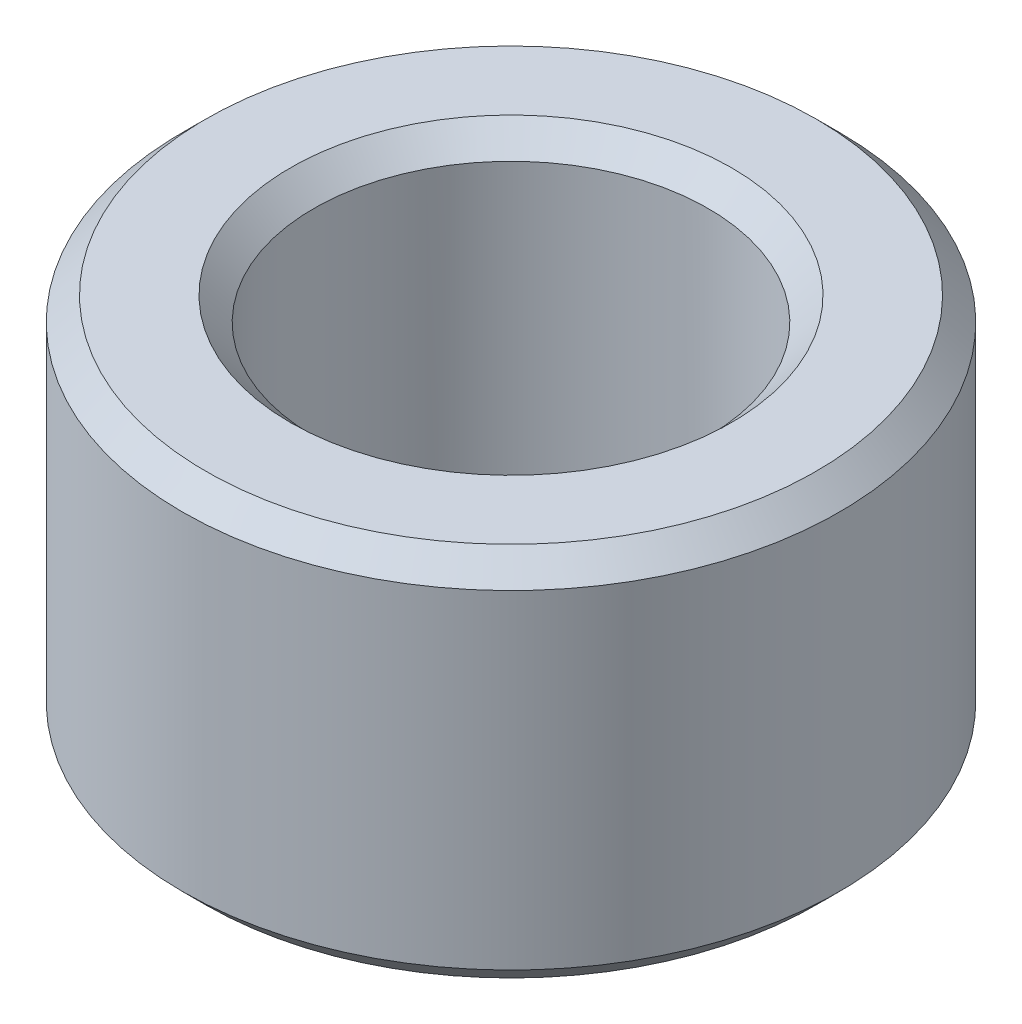
ISO-10303-21;
HEADER;
FILE_DESCRIPTION(('STEP AP214'),'2;1');
FILE_NAME('part.step','',(''),(''),'','','');
FILE_SCHEMA(('AUTOMOTIVE_DESIGN { 1 0 10303 214 1 1 1 1 }'));
ENDSEC;
DATA;
#1=APPLICATION_CONTEXT('core data for automotive mechanical design processes');
#2=APPLICATION_PROTOCOL_DEFINITION('international standard','automotive_design',2000,#1);
#3=PRODUCT_CONTEXT('',#1,'mechanical');
#4=PRODUCT('Part','Part','',(#3));
#5=PRODUCT_RELATED_PRODUCT_CATEGORY('part','',(#4));
#6=PRODUCT_DEFINITION_FORMATION('','',#4);
#7=PRODUCT_DEFINITION_CONTEXT('part definition',#1,'design');
#8=PRODUCT_DEFINITION('design','',#6,#7);
#9=PRODUCT_DEFINITION_SHAPE('','',#8);
#10=(LENGTH_UNIT() NAMED_UNIT(*) SI_UNIT(.MILLI.,.METRE.));
#11=(NAMED_UNIT(*) PLANE_ANGLE_UNIT() SI_UNIT($,.RADIAN.));
#12=(NAMED_UNIT(*) SI_UNIT($,.STERADIAN.) SOLID_ANGLE_UNIT());
#13=UNCERTAINTY_MEASURE_WITH_UNIT(LENGTH_MEASURE(1.E-05),#10,'distance_accuracy_value','');
#14=(GEOMETRIC_REPRESENTATION_CONTEXT(3) GLOBAL_UNCERTAINTY_ASSIGNED_CONTEXT((#13)) GLOBAL_UNIT_ASSIGNED_CONTEXT((#10,
#11,#12)) REPRESENTATION_CONTEXT('',''));
#15=CARTESIAN_POINT('',(0.,0.,0.));
#16=DIRECTION('',(0.,0.,1.));
#17=DIRECTION('',(1.,0.,0.));
#18=AXIS2_PLACEMENT_3D('',#15,#16,#17);
#19=CARTESIAN_POINT('',(0.,0.,0.));
#20=DIRECTION('',(0.,1.,0.));
#21=DIRECTION('',(0.,0.,1.));
#22=AXIS2_PLACEMENT_3D('',#19,#20,#21);
#23=CYLINDRICAL_SURFACE('',#22,2.1);
#24=CARTESIAN_POINT('',(0.,0.250000000050932,0.));
#25=DIRECTION('',(0.,-1.,0.));
#26=DIRECTION('',(1.,0.,0.));
#27=AXIS2_PLACEMENT_3D('',#24,#25,#26);
#28=CIRCLE('',#27,2.09999999998445);
#29=CARTESIAN_POINT('',(2.09999999998445,0.250000000050932,0.));
#30=VERTEX_POINT('',#29);
#31=EDGE_CURVE('E30',#30,#30,#28,.T.);
#32=ORIENTED_EDGE('',*,*,#31,.T.);
#33=EDGE_LOOP('',(#32));
#34=FACE_BOUND('',#33,.T.);
#35=CARTESIAN_POINT('',(0.,3.74999999996817,0.));
#36=DIRECTION('',(0.,1.,0.));
#37=DIRECTION('',(1.,0.,0.));
#38=AXIS2_PLACEMENT_3D('',#35,#36,#37);
#39=CIRCLE('',#38,2.09999999998445);
#40=CARTESIAN_POINT('',(2.09999999998445,3.74999999996817,0.));
#41=VERTEX_POINT('',#40);
#42=EDGE_CURVE('E33',#41,#41,#39,.T.);
#43=ORIENTED_EDGE('',*,*,#42,.T.);
#44=EDGE_LOOP('',(#43));
#45=FACE_BOUND('',#44,.T.);
#46=ADVANCED_FACE('F15',(#34,#45),#23,.F.);
#47=CARTESIAN_POINT('',(0.,4.0000000000191,0.));
#48=DIRECTION('',(0.,1.,0.));
#49=DIRECTION('',(0.,0.,1.));
#50=AXIS2_PLACEMENT_3D('',#47,#48,#49);
#51=CONICAL_SURFACE('',#50,2.34999999997854,0.785398163283761);
#52=ORIENTED_EDGE('',*,*,#42,.F.);
#53=EDGE_LOOP('',(#52));
#54=FACE_BOUND('',#53,.T.);
#55=CARTESIAN_POINT('',(0.,4.0000000000191,0.));
#56=DIRECTION('',(0.,1.,0.));
#57=DIRECTION('',(0.,0.,1.));
#58=AXIS2_PLACEMENT_3D('',#55,#56,#57);
#59=CIRCLE('',#58,2.34999999997854);
#60=CARTESIAN_POINT('',(0.,4.0000000000191,2.34999999997854));
#61=VERTEX_POINT('',#60);
#62=EDGE_CURVE('E18',#61,#61,#59,.F.);
#63=ORIENTED_EDGE('',*,*,#62,.F.);
#64=EDGE_LOOP('',(#63));
#65=FACE_BOUND('',#64,.T.);
#66=ADVANCED_FACE('F50',(#54,#65),#51,.F.);
#67=CARTESIAN_POINT('',(0.,5.6843418860808E-11,0.));
#68=DIRECTION('',(0.,-1.,0.));
#69=DIRECTION('',(0.,0.,-1.));
#70=AXIS2_PLACEMENT_3D('',#67,#68,#69);
#71=CONICAL_SURFACE('',#70,2.34999999997854,0.785398163397448);
#72=CARTESIAN_POINT('',(0.,5.6843418860808E-11,0.));
#73=DIRECTION('',(0.,-1.,0.));
#74=DIRECTION('',(0.,0.,-1.));
#75=AXIS2_PLACEMENT_3D('',#72,#73,#74);
#76=CIRCLE('',#75,2.34999999997854);
#77=CARTESIAN_POINT('',(0.,5.6843418860808E-11,-2.34999999997854));
#78=VERTEX_POINT('',#77);
#79=EDGE_CURVE('E40',#78,#78,#76,.T.);
#80=ORIENTED_EDGE('',*,*,#79,.T.);
#81=EDGE_LOOP('',(#80));
#82=FACE_BOUND('',#81,.T.);
#83=ORIENTED_EDGE('',*,*,#31,.F.);
#84=EDGE_LOOP('',(#83));
#85=FACE_BOUND('',#84,.T.);
#86=ADVANCED_FACE('F52',(#82,#85),#71,.F.);
#87=CARTESIAN_POINT('',(0.,4.,0.));
#88=DIRECTION('',(0.,1.,0.));
#89=DIRECTION('',(0.,0.,1.));
#90=AXIS2_PLACEMENT_3D('',#87,#88,#89);
#91=PLANE('',#90);
#92=ORIENTED_EDGE('',*,*,#62,.T.);
#93=EDGE_LOOP('',(#92));
#94=FACE_BOUND('',#93,.T.);
#95=CARTESIAN_POINT('',(0.,3.99999999996226,0.));
#96=DIRECTION('',(0.,-1.,0.));
#97=DIRECTION('',(0.,0.,-1.));
#98=AXIS2_PLACEMENT_3D('',#95,#96,#97);
#99=CIRCLE('',#98,3.24999999997999);
#100=CARTESIAN_POINT('',(0.,3.99999999996226,-3.24999999997999));
#101=VERTEX_POINT('',#100);
#102=EDGE_CURVE('E38',#101,#101,#99,.T.);
#103=ORIENTED_EDGE('',*,*,#102,.F.);
#104=EDGE_LOOP('',(#103));
#105=FACE_BOUND('',#104,.T.);
#106=ADVANCED_FACE('F47',(#94,#105),#91,.T.);
#107=CARTESIAN_POINT('',(0.,0.,0.));
#108=DIRECTION('',(0.,1.,0.));
#109=DIRECTION('',(0.,0.,1.));
#110=AXIS2_PLACEMENT_3D('',#107,#108,#109);
#111=PLANE('',#110);
#112=ORIENTED_EDGE('',*,*,#79,.F.);
#113=EDGE_LOOP('',(#112));
#114=FACE_BOUND('',#113,.T.);
#115=CARTESIAN_POINT('',(0.,0.,0.));
#116=DIRECTION('',(0.,1.,0.));
#117=DIRECTION('',(0.,0.,1.));
#118=AXIS2_PLACEMENT_3D('',#115,#116,#117);
#119=CIRCLE('',#118,3.2499999998663);
#120=CARTESIAN_POINT('',(0.,0.,3.2499999998663));
#121=VERTEX_POINT('',#120);
#122=EDGE_CURVE('E27',#121,#121,#119,.T.);
#123=ORIENTED_EDGE('',*,*,#122,.F.);
#124=EDGE_LOOP('',(#123));
#125=FACE_BOUND('',#124,.T.);
#126=ADVANCED_FACE('F76',(#114,#125),#111,.F.);
#127=CARTESIAN_POINT('',(0.,3.74999999996817,0.));
#128=DIRECTION('',(0.,-1.,0.));
#129=DIRECTION('',(0.,0.,-1.));
#130=AXIS2_PLACEMENT_3D('',#127,#128,#129);
#131=CONICAL_SURFACE('',#130,3.49999999997408,0.785398163397448);
#132=CARTESIAN_POINT('',(0.,3.75,0.));
#133=DIRECTION('',(0.,1.,0.));
#134=DIRECTION('',(0.,0.,1.));
#135=AXIS2_PLACEMENT_3D('',#132,#133,#134);
#136=CIRCLE('',#135,3.5);
#137=CARTESIAN_POINT('',(0.,3.75,3.5));
#138=VERTEX_POINT('',#137);
#139=EDGE_CURVE('E22',#138,#138,#136,.F.);
#140=ORIENTED_EDGE('',*,*,#139,.F.);
#141=EDGE_LOOP('',(#140));
#142=FACE_BOUND('',#141,.T.);
#143=ORIENTED_EDGE('',*,*,#102,.T.);
#144=EDGE_LOOP('',(#143));
#145=FACE_BOUND('',#144,.T.);
#146=ADVANCED_FACE('F69',(#142,#145),#131,.T.);
#147=CARTESIAN_POINT('',(0.,0.250000000107775,0.));
#148=DIRECTION('',(0.,1.,0.));
#149=DIRECTION('',(0.,0.,1.));
#150=AXIS2_PLACEMENT_3D('',#147,#148,#149);
#151=CONICAL_SURFACE('',#150,3.49999999997408,0.785398163397448);
#152=ORIENTED_EDGE('',*,*,#122,.T.);
#153=EDGE_LOOP('',(#152));
#154=FACE_BOUND('',#153,.T.);
#155=CARTESIAN_POINT('',(0.,0.25,0.));
#156=DIRECTION('',(0.,1.,0.));
#157=DIRECTION('',(0.,0.,1.));
#158=AXIS2_PLACEMENT_3D('',#155,#156,#157);
#159=CIRCLE('',#158,3.5);
#160=CARTESIAN_POINT('',(0.,0.25,3.5));
#161=VERTEX_POINT('',#160);
#162=EDGE_CURVE('E10',#161,#161,#159,.T.);
#163=ORIENTED_EDGE('',*,*,#162,.F.);
#164=EDGE_LOOP('',(#163));
#165=FACE_BOUND('',#164,.T.);
#166=ADVANCED_FACE('F64',(#154,#165),#151,.T.);
#167=CARTESIAN_POINT('',(0.,0.,0.));
#168=DIRECTION('',(0.,1.,0.));
#169=DIRECTION('',(0.,0.,1.));
#170=AXIS2_PLACEMENT_3D('',#167,#168,#169);
#171=CYLINDRICAL_SURFACE('',#170,3.5);
#172=ORIENTED_EDGE('',*,*,#162,.T.);
#173=EDGE_LOOP('',(#172));
#174=FACE_BOUND('',#173,.T.);
#175=ORIENTED_EDGE('',*,*,#139,.T.);
#176=EDGE_LOOP('',(#175));
#177=FACE_BOUND('',#176,.T.);
#178=ADVANCED_FACE('F62',(#174,#177),#171,.T.);
#179=CLOSED_SHELL('',(#46,#66,#86,#106,#126,#146,#166,#178));
#180=MANIFOLD_SOLID_BREP('B1',#179);
#181=ADVANCED_BREP_SHAPE_REPRESENTATION('',(#18,#180),#14);
#182=SHAPE_DEFINITION_REPRESENTATION(#9,#181);
ENDSEC;
END-ISO-10303-21;
